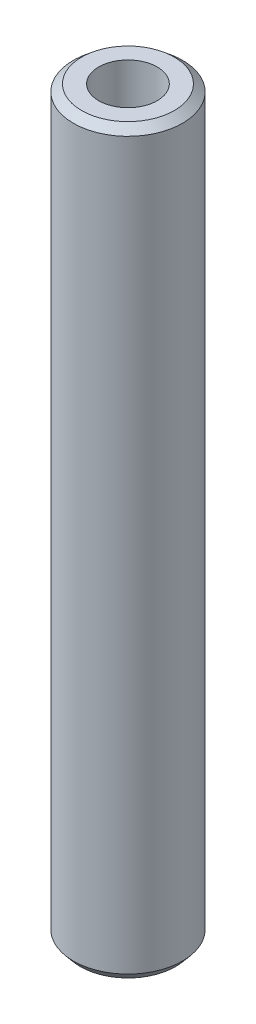
ISO-10303-21;
HEADER;
FILE_DESCRIPTION(('STEP AP214'),'2;1');
FILE_NAME('part.step','',(''),(''),'','','');
FILE_SCHEMA(('AUTOMOTIVE_DESIGN { 1 0 10303 214 1 1 1 1 }'));
ENDSEC;
DATA;
#1=APPLICATION_CONTEXT('core data for automotive mechanical design processes');
#2=APPLICATION_PROTOCOL_DEFINITION('international standard','automotive_design',2000,#1);
#3=PRODUCT_CONTEXT('',#1,'mechanical');
#4=PRODUCT('Part','Part','',(#3));
#5=PRODUCT_RELATED_PRODUCT_CATEGORY('part','',(#4));
#6=PRODUCT_DEFINITION_FORMATION('','',#4);
#7=PRODUCT_DEFINITION_CONTEXT('part definition',#1,'design');
#8=PRODUCT_DEFINITION('design','',#6,#7);
#9=PRODUCT_DEFINITION_SHAPE('','',#8);
#10=(LENGTH_UNIT() NAMED_UNIT(*) SI_UNIT(.MILLI.,.METRE.));
#11=(NAMED_UNIT(*) PLANE_ANGLE_UNIT() SI_UNIT($,.RADIAN.));
#12=(NAMED_UNIT(*) SI_UNIT($,.STERADIAN.) SOLID_ANGLE_UNIT());
#13=UNCERTAINTY_MEASURE_WITH_UNIT(LENGTH_MEASURE(1.E-05),#10,'distance_accuracy_value','');
#14=(GEOMETRIC_REPRESENTATION_CONTEXT(3) GLOBAL_UNCERTAINTY_ASSIGNED_CONTEXT((#13)) GLOBAL_UNIT_ASSIGNED_CONTEXT((#10,
#11,#12)) REPRESENTATION_CONTEXT('',''));
#15=CARTESIAN_POINT('',(0.,0.,0.));
#16=DIRECTION('',(0.,0.,1.));
#17=DIRECTION('',(1.,0.,0.));
#18=AXIS2_PLACEMENT_3D('',#15,#16,#17);
#19=CARTESIAN_POINT('',(0.,576.66493018795,0.));
#20=DIRECTION('',(0.,-1.,0.));
#21=DIRECTION('',(0.,0.,-1.));
#22=AXIS2_PLACEMENT_3D('',#19,#20,#21);
#23=CYLINDRICAL_SURFACE('',#22,42.5);
#24=CARTESIAN_POINT('',(0.,571.306277430054,0.));
#25=DIRECTION('',(0.,1.,0.));
#26=DIRECTION('',(0.,0.,1.));
#27=AXIS2_PLACEMENT_3D('',#24,#25,#26);
#28=CIRCLE('',#27,42.5);
#29=CARTESIAN_POINT('',(0.,571.306277430054,42.5));
#30=VERTEX_POINT('',#29);
#31=EDGE_CURVE('E50',#30,#30,#28,.F.);
#32=ORIENTED_EDGE('',*,*,#31,.T.);
#33=EDGE_LOOP('',(#32));
#34=FACE_BOUND('',#33,.T.);
#35=CARTESIAN_POINT('',(0.,6.4283876085568,0.));
#36=DIRECTION('',(0.,1.,0.));
#37=DIRECTION('',(0.,0.,1.));
#38=AXIS2_PLACEMENT_3D('',#35,#36,#37);
#39=CIRCLE('',#38,42.5);
#40=CARTESIAN_POINT('',(0.,6.4283876085568,42.5));
#41=VERTEX_POINT('',#40);
#42=EDGE_CURVE('E51',#41,#41,#39,.T.);
#43=ORIENTED_EDGE('',*,*,#42,.T.);
#44=EDGE_LOOP('',(#43));
#45=FACE_BOUND('',#44,.T.);
#46=ADVANCED_FACE('F39',(#34,#45),#23,.T.);
#47=CARTESIAN_POINT('',(0.,576.66493018795,0.));
#48=DIRECTION('',(0.,1.,0.));
#49=DIRECTION('',(0.,0.,1.));
#50=AXIS2_PLACEMENT_3D('',#47,#48,#49);
#51=PLANE('',#50);
#52=CARTESIAN_POINT('',(0.,576.66493018795,0.));
#53=DIRECTION('',(0.,1.,0.));
#54=DIRECTION('',(0.,0.,1.));
#55=AXIS2_PLACEMENT_3D('',#52,#53,#54);
#56=CIRCLE('',#55,36.0716123914434);
#57=CARTESIAN_POINT('',(0.,576.66493018795,36.0716123914434));
#58=VERTEX_POINT('',#57);
#59=EDGE_CURVE('E54',#58,#58,#56,.T.);
#60=ORIENTED_EDGE('',*,*,#59,.T.);
#61=EDGE_LOOP('',(#60));
#62=FACE_BOUND('',#61,.T.);
#63=CARTESIAN_POINT('',(0.,576.66493018795,0.));
#64=DIRECTION('',(0.,1.,0.));
#65=DIRECTION('',(0.,0.,1.));
#66=AXIS2_PLACEMENT_3D('',#63,#64,#65);
#67=CIRCLE('',#66,22.7875403847898);
#68=CARTESIAN_POINT('',(0.,576.66493018795,22.7875403847898));
#69=VERTEX_POINT('',#68);
#70=EDGE_CURVE('E58',#69,#69,#67,.T.);
#71=ORIENTED_EDGE('',*,*,#70,.F.);
#72=EDGE_LOOP('',(#71));
#73=FACE_BOUND('',#72,.T.);
#74=ADVANCED_FACE('F69',(#62,#73),#51,.T.);
#75=CARTESIAN_POINT('',(0.,0.,0.));
#76=DIRECTION('',(0.,1.,0.));
#77=DIRECTION('',(0.,0.,1.));
#78=AXIS2_PLACEMENT_3D('',#75,#76,#77);
#79=PLANE('',#78);
#80=CARTESIAN_POINT('',(0.,0.,0.));
#81=DIRECTION('',(0.,1.,0.));
#82=DIRECTION('',(0.,0.,1.));
#83=AXIS2_PLACEMENT_3D('',#80,#81,#82);
#84=CIRCLE('',#83,37.1413472421037);
#85=CARTESIAN_POINT('',(0.,0.,37.1413472421037));
#86=VERTEX_POINT('',#85);
#87=EDGE_CURVE('E10',#86,#86,#84,.F.);
#88=ORIENTED_EDGE('',*,*,#87,.T.);
#89=EDGE_LOOP('',(#88));
#90=FACE_BOUND('',#89,.T.);
#91=CARTESIAN_POINT('',(0.,0.,0.));
#92=DIRECTION('',(0.,1.,0.));
#93=DIRECTION('',(0.,0.,1.));
#94=AXIS2_PLACEMENT_3D('',#91,#92,#93);
#95=CIRCLE('',#94,22.7875403847898);
#96=CARTESIAN_POINT('',(0.,0.,22.7875403847898));
#97=VERTEX_POINT('',#96);
#98=EDGE_CURVE('E63',#97,#97,#95,.T.);
#99=ORIENTED_EDGE('',*,*,#98,.T.);
#100=EDGE_LOOP('',(#99));
#101=FACE_BOUND('',#100,.T.);
#102=ADVANCED_FACE('F75',(#90,#101),#79,.F.);
#103=CARTESIAN_POINT('',(0.,576.66493018795,0.));
#104=DIRECTION('',(0.,-1.,0.));
#105=DIRECTION('',(0.,0.,-1.));
#106=AXIS2_PLACEMENT_3D('',#103,#104,#105);
#107=CYLINDRICAL_SURFACE('',#106,22.7875403847898);
#108=ORIENTED_EDGE('',*,*,#70,.T.);
#109=EDGE_LOOP('',(#108));
#110=FACE_BOUND('',#109,.T.);
#111=ORIENTED_EDGE('',*,*,#98,.F.);
#112=EDGE_LOOP('',(#111));
#113=FACE_BOUND('',#112,.T.);
#114=ADVANCED_FACE('F70',(#110,#113),#107,.F.);
#115=CARTESIAN_POINT('',(0.,576.66493018795,0.));
#116=DIRECTION('',(0.,-1.,0.));
#117=DIRECTION('',(0.,0.,-1.));
#118=AXIS2_PLACEMENT_3D('',#115,#116,#117);
#119=CONICAL_SURFACE('',#118,36.0716123914434,0.875905389084307);
#120=ORIENTED_EDGE('',*,*,#31,.F.);
#121=EDGE_LOOP('',(#120));
#122=FACE_BOUND('',#121,.T.);
#123=ORIENTED_EDGE('',*,*,#59,.F.);
#124=EDGE_LOOP('',(#123));
#125=FACE_BOUND('',#124,.T.);
#126=ADVANCED_FACE('F81',(#122,#125),#119,.T.);
#127=CARTESIAN_POINT('',(0.,6.4283876085568,0.));
#128=DIRECTION('',(0.,1.,0.));
#129=DIRECTION('',(0.,0.,1.));
#130=AXIS2_PLACEMENT_3D('',#127,#128,#129);
#131=CONICAL_SURFACE('',#130,42.5,0.694890937710583);
#132=CARTESIAN_POINT('',(0.,0.,37.1413472421037));
#133=CARTESIAN_POINT('',(0.,0.066962370922464,37.1971665416651));
#134=CARTESIAN_POINT('',(0.,0.133924741844931,37.2529858412265));
#135=CARTESIAN_POINT('',(0.,0.267849483689866,37.3646244403493));
#136=CARTESIAN_POINT('',(0.,0.334811854612333,37.4204437399108));
#137=CARTESIAN_POINT('',(0.,0.468736596457266,37.5320823390336));
#138=CARTESIAN_POINT('',(0.,0.535698967379732,37.587901638595));
#139=CARTESIAN_POINT('',(0.,0.669623709224665,37.6995402377179));
#140=CARTESIAN_POINT('',(0.,0.736586080147132,37.7553595372793));
#141=CARTESIAN_POINT('',(0.,0.870510821992065,37.8669981364021));
#142=CARTESIAN_POINT('',(0.,0.937473192914532,37.9228174359635));
#143=CARTESIAN_POINT('',(0.,1.07139793475947,38.0344560350864));
#144=CARTESIAN_POINT('',(0.,1.13836030568193,38.0902753346478));
#145=CARTESIAN_POINT('',(0.,1.27228504752686,38.2019139337706));
#146=CARTESIAN_POINT('',(0.,1.33924741844933,38.2577332333321));
#147=CARTESIAN_POINT('',(0.,1.47317216029426,38.3693718324549));
#148=CARTESIAN_POINT('',(0.,1.54013453121673,38.4251911320163));
#149=CARTESIAN_POINT('',(0.,1.67405927306166,38.5368297311392));
#150=CARTESIAN_POINT('',(0.,1.74102164398413,38.5926490307006));
#151=CARTESIAN_POINT('',(0.,1.87494638582906,38.7042876298234));
#152=CARTESIAN_POINT('',(0.,1.94190875675153,38.7601069293848));
#153=CARTESIAN_POINT('',(0.,2.07583349859646,38.8717455285077));
#154=CARTESIAN_POINT('',(0.,2.14279586951893,38.9275648280691));
#155=CARTESIAN_POINT('',(0.,2.27672061136386,39.0392034271919));
#156=CARTESIAN_POINT('',(0.,2.34368298228633,39.0950227267534));
#157=CARTESIAN_POINT('',(0.,2.47760772413127,39.2066613258762));
#158=CARTESIAN_POINT('',(0.,2.54457009505373,39.2624806254376));
#159=CARTESIAN_POINT('',(0.,2.67849483689866,39.3741192245605));
#160=CARTESIAN_POINT('',(0.,2.74545720782113,39.4299385241219));
#161=CARTESIAN_POINT('',(0.,2.87938194966606,39.5415771232447));
#162=CARTESIAN_POINT('',(0.,2.94634432058853,39.5973964228061));
#163=CARTESIAN_POINT('',(0.,3.08026906243346,39.709035021929));
#164=CARTESIAN_POINT('',(0.,3.14723143335593,39.7648543214904));
#165=CARTESIAN_POINT('',(0.,3.28115617520086,39.8764929206133));
#166=CARTESIAN_POINT('',(0.,3.34811854612333,39.9323122201747));
#167=CARTESIAN_POINT('',(0.,3.48204328796826,40.0439508192975));
#168=CARTESIAN_POINT('',(0.,3.54900565889073,40.0997701188589));
#169=CARTESIAN_POINT('',(0.,3.68293040073566,40.2114087179818));
#170=CARTESIAN_POINT('',(0.,3.74989277165813,40.2672280175432));
#171=CARTESIAN_POINT('',(0.,3.88381751350306,40.378866616666));
#172=CARTESIAN_POINT('',(0.,3.95077988442553,40.4346859162275));
#173=CARTESIAN_POINT('',(0.,4.08470462627046,40.5463245153503));
#174=CARTESIAN_POINT('',(0.,4.15166699719293,40.6021438149117));
#175=CARTESIAN_POINT('',(0.,4.28559173903786,40.7137824140346));
#176=CARTESIAN_POINT('',(0.,4.35255410996033,40.769601713596));
#177=CARTESIAN_POINT('',(0.,4.48647885180526,40.8812403127188));
#178=CARTESIAN_POINT('',(0.,4.55344122272773,40.9370596122802));
#179=CARTESIAN_POINT('',(0.,4.68736596457266,41.0486982114031));
#180=CARTESIAN_POINT('',(0.,4.75432833549513,41.1045175109645));
#181=CARTESIAN_POINT('',(0.,4.88825307734006,41.2161561100873));
#182=CARTESIAN_POINT('',(0.,4.95521544826253,41.2719754096488));
#183=CARTESIAN_POINT('',(0.,5.08914019010746,41.3836140087716));
#184=CARTESIAN_POINT('',(0.,5.15610256102993,41.439433308333));
#185=CARTESIAN_POINT('',(0.,5.29002730287486,41.5510719074559));
#186=CARTESIAN_POINT('',(0.,5.35698967379733,41.6068912070173));
#187=CARTESIAN_POINT('',(0.,5.49091441564226,41.7185298061401));
#188=CARTESIAN_POINT('',(0.,5.55787678656473,41.7743491057015));
#189=CARTESIAN_POINT('',(0.,5.69180152840966,41.8859877048244));
#190=CARTESIAN_POINT('',(0.,5.75876389933213,41.9418070043858));
#191=CARTESIAN_POINT('',(0.,5.89268864117706,42.0534456035086));
#192=CARTESIAN_POINT('',(0.,5.95965101209953,42.1092649030701));
#193=CARTESIAN_POINT('',(0.,6.09357575394446,42.2209035021929));
#194=CARTESIAN_POINT('',(0.,6.16053812486693,42.2767228017543));
#195=CARTESIAN_POINT('',(0.,6.29446286671186,42.3883614008772));
#196=CARTESIAN_POINT('',(0.,6.36142523763433,42.4441807004386));
#197=CARTESIAN_POINT('',(0.,6.4283876085568,42.5));
#198=B_SPLINE_CURVE_WITH_KNOTS('',3,(#132,#133,#134,#135,#136,#137,#138,#139,#140,#141,#142,
#143,#144,#145,#146,#147,#148,#149,#150,#151,#152,#153,#154,#155,#156,#157,#158,#159,#160,#161,
#162,#163,#164,#165,#166,#167,#168,#169,#170,#171,#172,#173,#174,#175,#176,#177,#178,#179,#180,
#181,#182,#183,#184,#185,#186,#187,#188,#189,#190,#191,#192,#193,#194,#195,#196,#197),
.UNSPECIFIED.,.F.,.F.,(4,2,2,2,2,2,2,2,2,2,2,2,2,2,2,2,2,2,2,2,2,2,2,2,2,2,2,2,2,2,2,2,4),(0.,
0.261529692210599,0.523059384421193,0.784589076631792,1.04611876884239,1.30764846105299,
1.56917815326359,1.83070784547419,2.09223753768479,2.35376722989538,2.61529692210598,
2.87682661431658,3.13835630652718,3.39988599873778,3.66141569094838,3.92294538315897,
4.18447507536957,4.44600476758017,4.70753445979077,4.96906415200137,5.23059384421197,
5.49212353642256,5.75365322863316,6.01518292084376,6.27671261305436,6.53824230526496,
6.79977199747556,7.06130168968615,7.32283138189675,7.58436107410735,7.84589076631795,
8.10742045852855,8.36895015073915),.UNSPECIFIED.);
#199=EDGE_CURVE('BSEAM45',#86,#41,#198,.T.);
#200=ORIENTED_EDGE('',*,*,#87,.F.);
#201=ORIENTED_EDGE('',*,*,#42,.F.);
#202=ORIENTED_EDGE('',*,*,#199,.T.);
#203=ORIENTED_EDGE('',*,*,#199,.F.);
#204=EDGE_LOOP('',(#200,#202,#201,#203));
#205=FACE_BOUND('',#204,.T.);
#206=ADVANCED_FACE('F45',(#205),#131,.T.);
#207=CLOSED_SHELL('',(#46,#74,#102,#114,#126,#206));
#208=MANIFOLD_SOLID_BREP('B2',#207);
#209=ADVANCED_BREP_SHAPE_REPRESENTATION('',(#18,#208),#14);
#210=SHAPE_DEFINITION_REPRESENTATION(#9,#209);
ENDSEC;
END-ISO-10303-21;
